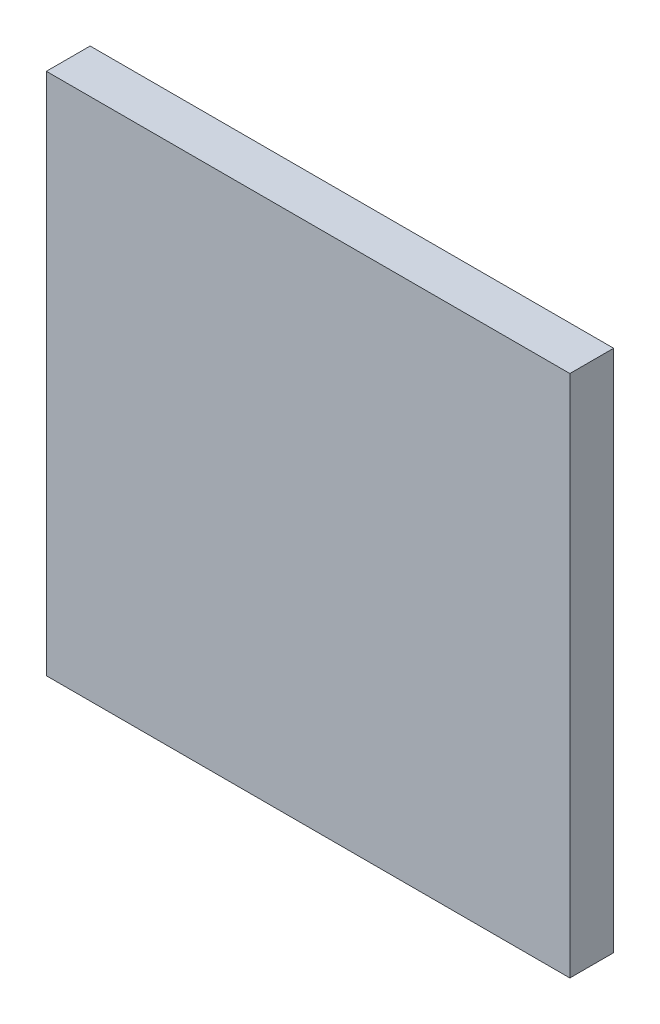
ISO-10303-21;
HEADER;
FILE_DESCRIPTION(('STEP AP214'),'2;1');
FILE_NAME('part.step','',(''),(''),'','','');
FILE_SCHEMA(('AUTOMOTIVE_DESIGN { 1 0 10303 214 1 1 1 1 }'));
ENDSEC;
DATA;
#1=APPLICATION_CONTEXT('core data for automotive mechanical design processes');
#2=APPLICATION_PROTOCOL_DEFINITION('international standard','automotive_design',2000,#1);
#3=PRODUCT_CONTEXT('',#1,'mechanical');
#4=PRODUCT('Part','Part','',(#3));
#5=PRODUCT_RELATED_PRODUCT_CATEGORY('part','',(#4));
#6=PRODUCT_DEFINITION_FORMATION('','',#4);
#7=PRODUCT_DEFINITION_CONTEXT('part definition',#1,'design');
#8=PRODUCT_DEFINITION('design','',#6,#7);
#9=PRODUCT_DEFINITION_SHAPE('','',#8);
#10=(LENGTH_UNIT() NAMED_UNIT(*) SI_UNIT(.MILLI.,.METRE.));
#11=(NAMED_UNIT(*) PLANE_ANGLE_UNIT() SI_UNIT($,.RADIAN.));
#12=(NAMED_UNIT(*) SI_UNIT($,.STERADIAN.) SOLID_ANGLE_UNIT());
#13=UNCERTAINTY_MEASURE_WITH_UNIT(LENGTH_MEASURE(1.E-05),#10,'distance_accuracy_value','');
#14=(GEOMETRIC_REPRESENTATION_CONTEXT(3) GLOBAL_UNCERTAINTY_ASSIGNED_CONTEXT((#13)) GLOBAL_UNIT_ASSIGNED_CONTEXT((#10,
#11,#12)) REPRESENTATION_CONTEXT('',''));
#15=CARTESIAN_POINT('',(0.,0.,0.));
#16=DIRECTION('',(0.,0.,1.));
#17=DIRECTION('',(1.,0.,0.));
#18=AXIS2_PLACEMENT_3D('',#15,#16,#17);
#19=CARTESIAN_POINT('',(1.1245240521277,1.5391048737361,1.7496000059366));
#20=DIRECTION('',(0.,1.,0.));
#21=DIRECTION('',(0.,0.,1.));
#22=AXIS2_PLACEMENT_3D('',#19,#20,#21);
#23=PLANE('',#22);
#24=DIRECTION('',(0.,0.,1.));
#25=VECTOR('',#24,1.);
#26=CARTESIAN_POINT('',(1.1221325446967,1.5391048737361,1.7492000059366));
#27=LINE('',#26,#25);
#28=CARTESIAN_POINT('',(1.1221325446967,1.5391048737361,1.7492000059366));
#29=VERTEX_POINT('',#28);
#30=CARTESIAN_POINT('',(1.1221325446967,1.5391048737361,1.7496000059366));
#31=VERTEX_POINT('',#30);
#32=EDGE_CURVE('E11',#29,#31,#27,.T.);
#33=ORIENTED_EDGE('',*,*,#32,.T.);
#34=DIRECTION('',(1.,0.,0.));
#35=VECTOR('',#34,1.);
#36=CARTESIAN_POINT('',(1.1221325446967,1.5391048737361,1.7496000059366));
#37=LINE('',#36,#35);
#38=CARTESIAN_POINT('',(1.1269155595587,1.5391048737361,1.7496000059366));
#39=VERTEX_POINT('',#38);
#40=EDGE_CURVE('E24',#31,#39,#37,.T.);
#41=ORIENTED_EDGE('',*,*,#40,.T.);
#42=DIRECTION('',(0.,0.,1.));
#43=VECTOR('',#42,1.);
#44=CARTESIAN_POINT('',(1.1269155595587,1.5391048737361,1.7492000059366));
#45=LINE('',#44,#43);
#46=CARTESIAN_POINT('',(1.1269155595587,1.5391048737361,1.7492000059366));
#47=VERTEX_POINT('',#46);
#48=EDGE_CURVE('E85',#47,#39,#45,.T.);
#49=ORIENTED_EDGE('',*,*,#48,.F.);
#50=DIRECTION('',(1.,0.,0.));
#51=VECTOR('',#50,1.);
#52=CARTESIAN_POINT('',(1.1221325446967,1.5391048737361,1.7492000059366));
#53=LINE('',#52,#51);
#54=EDGE_CURVE('E83',#29,#47,#53,.T.);
#55=ORIENTED_EDGE('',*,*,#54,.F.);
#56=EDGE_LOOP('',(#33,#41,#49,#55));
#57=FACE_BOUND('',#56,.T.);
#58=ADVANCED_FACE('F17',(#57),#23,.T.);
#59=CARTESIAN_POINT('',(1.1269155595587,1.5367133663051,1.7496000059366));
#60=DIRECTION('',(1.,0.,0.));
#61=DIRECTION('',(0.,0.,-1.));
#62=AXIS2_PLACEMENT_3D('',#59,#60,#61);
#63=PLANE('',#62);
#64=ORIENTED_EDGE('',*,*,#48,.T.);
#65=DIRECTION('',(0.,-1.,0.));
#66=VECTOR('',#65,1.);
#67=CARTESIAN_POINT('',(1.1269155595587,1.5391048737361,1.7496000059366));
#68=LINE('',#67,#66);
#69=CARTESIAN_POINT('',(1.1269155595587,1.5343218588741,1.7496000059366));
#70=VERTEX_POINT('',#69);
#71=EDGE_CURVE('E81',#39,#70,#68,.T.);
#72=ORIENTED_EDGE('',*,*,#71,.T.);
#73=DIRECTION('',(0.,0.,1.));
#74=VECTOR('',#73,1.);
#75=CARTESIAN_POINT('',(1.1269155595587,1.5343218588741,1.7492000059366));
#76=LINE('',#75,#74);
#77=CARTESIAN_POINT('',(1.1269155595587,1.5343218588741,1.7492000059366));
#78=VERTEX_POINT('',#77);
#79=EDGE_CURVE('E79',#78,#70,#76,.T.);
#80=ORIENTED_EDGE('',*,*,#79,.F.);
#81=DIRECTION('',(0.,-1.,0.));
#82=VECTOR('',#81,1.);
#83=CARTESIAN_POINT('',(1.1269155595587,1.5391048737361,1.7492000059366));
#84=LINE('',#83,#82);
#85=EDGE_CURVE('E70',#47,#78,#84,.T.);
#86=ORIENTED_EDGE('',*,*,#85,.F.);
#87=EDGE_LOOP('',(#64,#72,#80,#86));
#88=FACE_BOUND('',#87,.T.);
#89=ADVANCED_FACE('F90',(#88),#63,.T.);
#90=CARTESIAN_POINT('',(1.1245240521277,1.5343218588741,1.7496000059366));
#91=DIRECTION('',(0.,-1.,0.));
#92=DIRECTION('',(0.,0.,-1.));
#93=AXIS2_PLACEMENT_3D('',#90,#91,#92);
#94=PLANE('',#93);
#95=ORIENTED_EDGE('',*,*,#79,.T.);
#96=DIRECTION('',(-1.,0.,0.));
#97=VECTOR('',#96,1.);
#98=CARTESIAN_POINT('',(1.1269155595587,1.5343218588741,1.7496000059366));
#99=LINE('',#98,#97);
#100=CARTESIAN_POINT('',(1.1221325446967,1.5343218588741,1.7496000059366));
#101=VERTEX_POINT('',#100);
#102=EDGE_CURVE('E60',#70,#101,#99,.T.);
#103=ORIENTED_EDGE('',*,*,#102,.T.);
#104=DIRECTION('',(0.,0.,1.));
#105=VECTOR('',#104,1.);
#106=CARTESIAN_POINT('',(1.1221325446967,1.5343218588741,1.7492000059366));
#107=LINE('',#106,#105);
#108=CARTESIAN_POINT('',(1.1221325446967,1.5343218588741,1.7492000059366));
#109=VERTEX_POINT('',#108);
#110=EDGE_CURVE('E54',#109,#101,#107,.T.);
#111=ORIENTED_EDGE('',*,*,#110,.F.);
#112=DIRECTION('',(-1.,0.,0.));
#113=VECTOR('',#112,1.);
#114=CARTESIAN_POINT('',(1.1269155595587,1.5343218588741,1.7492000059366));
#115=LINE('',#114,#113);
#116=EDGE_CURVE('E58',#78,#109,#115,.T.);
#117=ORIENTED_EDGE('',*,*,#116,.F.);
#118=EDGE_LOOP('',(#95,#103,#111,#117));
#119=FACE_BOUND('',#118,.T.);
#120=ADVANCED_FACE('F57',(#119),#94,.T.);
#121=CARTESIAN_POINT('',(1.1221325446967,1.5367133663051,1.7496000059366));
#122=DIRECTION('',(-1.,0.,0.));
#123=DIRECTION('',(0.,0.,1.));
#124=AXIS2_PLACEMENT_3D('',#121,#122,#123);
#125=PLANE('',#124);
#126=ORIENTED_EDGE('',*,*,#110,.T.);
#127=DIRECTION('',(0.,1.,0.));
#128=VECTOR('',#127,1.);
#129=CARTESIAN_POINT('',(1.1221325446967,1.5343218588741,1.7496000059366));
#130=LINE('',#129,#128);
#131=EDGE_CURVE('E71',#101,#31,#130,.T.);
#132=ORIENTED_EDGE('',*,*,#131,.T.);
#133=ORIENTED_EDGE('',*,*,#32,.F.);
#134=DIRECTION('',(0.,1.,0.));
#135=VECTOR('',#134,1.);
#136=CARTESIAN_POINT('',(1.1221325446967,1.5343218588741,1.7492000059366));
#137=LINE('',#136,#135);
#138=EDGE_CURVE('E68',#109,#29,#137,.T.);
#139=ORIENTED_EDGE('',*,*,#138,.F.);
#140=EDGE_LOOP('',(#126,#132,#133,#139));
#141=FACE_BOUND('',#140,.T.);
#142=ADVANCED_FACE('F73',(#141),#125,.T.);
#143=CARTESIAN_POINT('',(1.1221325446967,1.5367133663051,1.7492000059366));
#144=DIRECTION('',(0.,0.,-1.));
#145=DIRECTION('',(-1.,0.,0.));
#146=AXIS2_PLACEMENT_3D('',#143,#144,#145);
#147=PLANE('',#146);
#148=ORIENTED_EDGE('',*,*,#54,.T.);
#149=ORIENTED_EDGE('',*,*,#85,.T.);
#150=ORIENTED_EDGE('',*,*,#116,.T.);
#151=ORIENTED_EDGE('',*,*,#138,.T.);
#152=EDGE_LOOP('',(#148,#149,#150,#151));
#153=FACE_BOUND('',#152,.T.);
#154=ADVANCED_FACE('F67',(#153),#147,.T.);
#155=CARTESIAN_POINT('',(1.1221325446967,1.5367133663051,1.7496000059366));
#156=DIRECTION('',(0.,0.,-1.));
#157=DIRECTION('',(-1.,0.,0.));
#158=AXIS2_PLACEMENT_3D('',#155,#156,#157);
#159=PLANE('',#158);
#160=ORIENTED_EDGE('',*,*,#40,.F.);
#161=ORIENTED_EDGE('',*,*,#131,.F.);
#162=ORIENTED_EDGE('',*,*,#102,.F.);
#163=ORIENTED_EDGE('',*,*,#71,.F.);
#164=EDGE_LOOP('',(#160,#161,#162,#163));
#165=FACE_BOUND('',#164,.T.);
#166=ADVANCED_FACE('F91',(#165),#159,.F.);
#167=CLOSED_SHELL('',(#58,#89,#120,#142,#154,#166));
#168=MANIFOLD_SOLID_BREP('B1',#167);
#169=ADVANCED_BREP_SHAPE_REPRESENTATION('',(#18,#168),#14);
#170=SHAPE_DEFINITION_REPRESENTATION(#9,#169);
ENDSEC;
END-ISO-10303-21;
